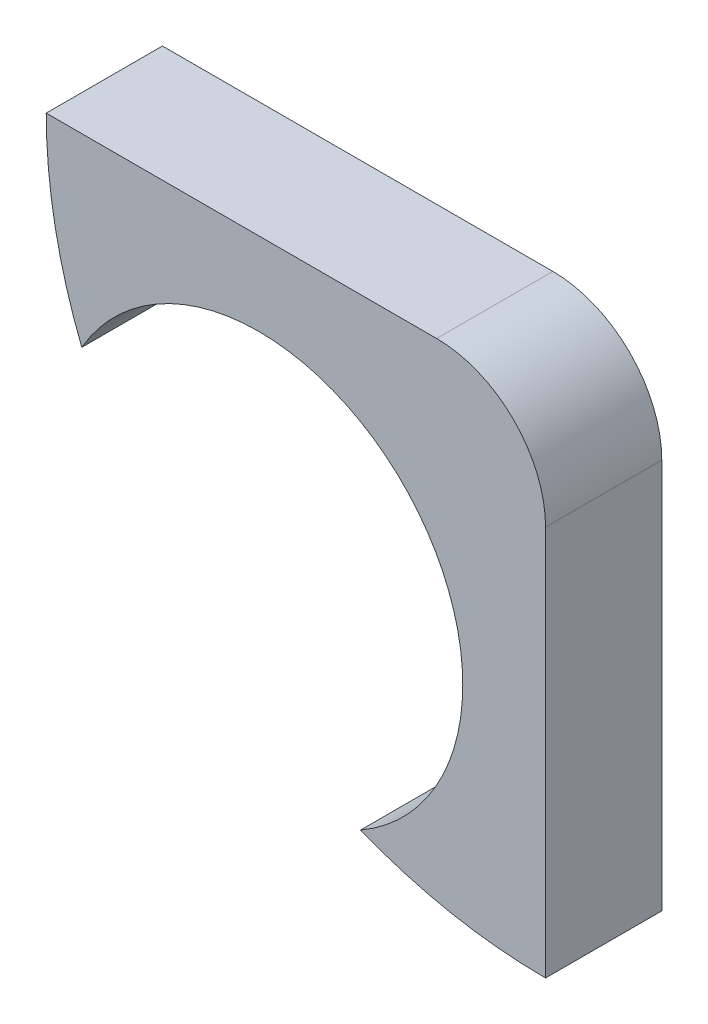
ISO-10303-21;
HEADER;
FILE_DESCRIPTION(('STEP AP214'),'2;1');
FILE_NAME('part.step','',(''),(''),'','','');
FILE_SCHEMA(('AUTOMOTIVE_DESIGN { 1 0 10303 214 1 1 1 1 }'));
ENDSEC;
DATA;
#1=APPLICATION_CONTEXT('core data for automotive mechanical design processes');
#2=APPLICATION_PROTOCOL_DEFINITION('international standard','automotive_design',2000,#1);
#3=PRODUCT_CONTEXT('',#1,'mechanical');
#4=PRODUCT('Part','Part','',(#3));
#5=PRODUCT_RELATED_PRODUCT_CATEGORY('part','',(#4));
#6=PRODUCT_DEFINITION_FORMATION('','',#4);
#7=PRODUCT_DEFINITION_CONTEXT('part definition',#1,'design');
#8=PRODUCT_DEFINITION('design','',#6,#7);
#9=PRODUCT_DEFINITION_SHAPE('','',#8);
#10=(LENGTH_UNIT() NAMED_UNIT(*) SI_UNIT(.MILLI.,.METRE.));
#11=(NAMED_UNIT(*) PLANE_ANGLE_UNIT() SI_UNIT($,.RADIAN.));
#12=(NAMED_UNIT(*) SI_UNIT($,.STERADIAN.) SOLID_ANGLE_UNIT());
#13=UNCERTAINTY_MEASURE_WITH_UNIT(LENGTH_MEASURE(1.E-05),#10,'distance_accuracy_value','');
#14=(GEOMETRIC_REPRESENTATION_CONTEXT(3) GLOBAL_UNCERTAINTY_ASSIGNED_CONTEXT((#13)) GLOBAL_UNIT_ASSIGNED_CONTEXT((#10,
#11,#12)) REPRESENTATION_CONTEXT('',''));
#15=CARTESIAN_POINT('',(0.,0.,0.));
#16=DIRECTION('',(0.,0.,1.));
#17=DIRECTION('',(1.,0.,0.));
#18=AXIS2_PLACEMENT_3D('',#15,#16,#17);
#19=CARTESIAN_POINT('',(19.95,19.95,18.95));
#20=DIRECTION('',(0.,0.,1.));
#21=DIRECTION('',(1.,0.,0.));
#22=AXIS2_PLACEMENT_3D('',#19,#20,#21);
#23=PLANE('',#22);
#24=CARTESIAN_POINT('',(19.95,19.95,18.95));
#25=DIRECTION('',(0.,0.,1.));
#26=DIRECTION('',(1.,0.,0.));
#27=AXIS2_PLACEMENT_3D('',#24,#25,#26);
#28=CIRCLE('',#27,6.875);
#29=CARTESIAN_POINT('',(17.4018583423999,13.5646574803852,18.95));
#30=VERTEX_POINT('',#29);
#31=CARTESIAN_POINT('',(19.95,13.0750000000002,18.95));
#32=VERTEX_POINT('',#31);
#33=EDGE_CURVE('E86',#30,#32,#28,.T.);
#34=ORIENTED_EDGE('',*,*,#33,.F.);
#35=CARTESIAN_POINT('',(16.,16.,18.95));
#36=DIRECTION('',(0.,0.,-1.));
#37=DIRECTION('',(1.,0.,0.));
#38=AXIS2_PLACEMENT_3D('',#35,#36,#37);
#39=CIRCLE('',#38,2.81);
#40=CARTESIAN_POINT('',(13.564657480385,17.4018583423996,18.95));
#41=VERTEX_POINT('',#40);
#42=EDGE_CURVE('E26',#41,#30,#39,.T.);
#43=ORIENTED_EDGE('',*,*,#42,.F.);
#44=CARTESIAN_POINT('',(19.95,19.95,18.95));
#45=DIRECTION('',(0.,0.,1.));
#46=DIRECTION('',(1.,0.,0.));
#47=AXIS2_PLACEMENT_3D('',#44,#45,#46);
#48=CIRCLE('',#47,6.875);
#49=CARTESIAN_POINT('',(13.0749999999998,19.95,18.95));
#50=VERTEX_POINT('',#49);
#51=EDGE_CURVE('E19',#50,#41,#48,.T.);
#52=ORIENTED_EDGE('',*,*,#51,.F.);
#53=DIRECTION('',(-1.,0.,0.));
#54=VECTOR('',#53,1.);
#55=CARTESIAN_POINT('',(18.45,19.95,18.95));
#56=LINE('',#55,#54);
#57=CARTESIAN_POINT('',(18.45,19.95,18.95));
#58=VERTEX_POINT('',#57);
#59=EDGE_CURVE('E134',#58,#50,#56,.T.);
#60=ORIENTED_EDGE('',*,*,#59,.F.);
#61=CARTESIAN_POINT('',(18.45,18.45,18.95));
#62=DIRECTION('',(0.,0.,1.));
#63=DIRECTION('',(1.,0.,0.));
#64=AXIS2_PLACEMENT_3D('',#61,#62,#63);
#65=CIRCLE('',#64,1.5);
#66=CARTESIAN_POINT('',(19.95,18.45,18.95));
#67=VERTEX_POINT('',#66);
#68=EDGE_CURVE('E88',#67,#58,#65,.T.);
#69=ORIENTED_EDGE('',*,*,#68,.F.);
#70=DIRECTION('',(0.,1.,0.));
#71=VECTOR('',#70,1.);
#72=CARTESIAN_POINT('',(19.95,13.0750000000002,18.95));
#73=LINE('',#72,#71);
#74=EDGE_CURVE('E83',#32,#67,#73,.T.);
#75=ORIENTED_EDGE('',*,*,#74,.F.);
#76=EDGE_LOOP('',(#34,#43,#52,#60,#69,#75));
#77=FACE_BOUND('',#76,.T.);
#78=ADVANCED_FACE('F15',(#77),#23,.F.);
#79=CARTESIAN_POINT('',(19.95,19.95,20.55));
#80=DIRECTION('',(0.,0.,1.));
#81=DIRECTION('',(1.,0.,0.));
#82=AXIS2_PLACEMENT_3D('',#79,#80,#81);
#83=PLANE('',#82);
#84=CARTESIAN_POINT('',(19.95,19.95,20.55));
#85=DIRECTION('',(0.,0.,1.));
#86=DIRECTION('',(1.,0.,0.));
#87=AXIS2_PLACEMENT_3D('',#84,#85,#86);
#88=CIRCLE('',#87,6.875);
#89=CARTESIAN_POINT('',(17.4018583423999,13.5646574803852,20.55));
#90=VERTEX_POINT('',#89);
#91=CARTESIAN_POINT('',(19.95,13.0750000000002,20.55));
#92=VERTEX_POINT('',#91);
#93=EDGE_CURVE('E105',#90,#92,#88,.T.);
#94=ORIENTED_EDGE('',*,*,#93,.T.);
#95=DIRECTION('',(0.,1.,0.));
#96=VECTOR('',#95,1.);
#97=CARTESIAN_POINT('',(19.95,13.0750000000002,20.55));
#98=LINE('',#97,#96);
#99=CARTESIAN_POINT('',(19.95,18.45,20.55));
#100=VERTEX_POINT('',#99);
#101=EDGE_CURVE('E100',#92,#100,#98,.T.);
#102=ORIENTED_EDGE('',*,*,#101,.T.);
#103=CARTESIAN_POINT('',(18.45,18.45,20.55));
#104=DIRECTION('',(0.,0.,1.));
#105=DIRECTION('',(1.,0.,0.));
#106=AXIS2_PLACEMENT_3D('',#103,#104,#105);
#107=CIRCLE('',#106,1.5);
#108=CARTESIAN_POINT('',(18.45,19.95,20.55));
#109=VERTEX_POINT('',#108);
#110=EDGE_CURVE('E122',#100,#109,#107,.T.);
#111=ORIENTED_EDGE('',*,*,#110,.T.);
#112=DIRECTION('',(-1.,0.,0.));
#113=VECTOR('',#112,1.);
#114=CARTESIAN_POINT('',(18.45,19.95,20.55));
#115=LINE('',#114,#113);
#116=CARTESIAN_POINT('',(13.0749999999998,19.95,20.55));
#117=VERTEX_POINT('',#116);
#118=EDGE_CURVE('E143',#109,#117,#115,.T.);
#119=ORIENTED_EDGE('',*,*,#118,.T.);
#120=CARTESIAN_POINT('',(19.95,19.95,20.55));
#121=DIRECTION('',(0.,0.,1.));
#122=DIRECTION('',(1.,0.,0.));
#123=AXIS2_PLACEMENT_3D('',#120,#121,#122);
#124=CIRCLE('',#123,6.875);
#125=CARTESIAN_POINT('',(13.564657480385,17.4018583423996,20.55));
#126=VERTEX_POINT('',#125);
#127=EDGE_CURVE('E149',#117,#126,#124,.T.);
#128=ORIENTED_EDGE('',*,*,#127,.T.);
#129=CARTESIAN_POINT('',(16.,16.,20.55));
#130=DIRECTION('',(0.,0.,-1.));
#131=DIRECTION('',(1.,0.,0.));
#132=AXIS2_PLACEMENT_3D('',#129,#130,#131);
#133=CIRCLE('',#132,2.81);
#134=EDGE_CURVE('E10',#126,#90,#133,.T.);
#135=ORIENTED_EDGE('',*,*,#134,.T.);
#136=EDGE_LOOP('',(#94,#102,#111,#119,#128,#135));
#137=FACE_BOUND('',#136,.T.);
#138=ADVANCED_FACE('F276',(#137),#83,.T.);
#139=CARTESIAN_POINT('',(16.,16.,20.55));
#140=DIRECTION('',(0.,0.,-1.));
#141=DIRECTION('',(-1.,0.,0.));
#142=AXIS2_PLACEMENT_3D('',#139,#140,#141);
#143=CYLINDRICAL_SURFACE('',#142,2.81);
#144=ORIENTED_EDGE('',*,*,#42,.T.);
#145=DIRECTION('',(0.,0.,-1.));
#146=VECTOR('',#145,1.);
#147=CARTESIAN_POINT('',(17.4018583423999,13.5646574803852,20.55));
#148=LINE('',#147,#146);
#149=EDGE_CURVE('E94',#90,#30,#148,.T.);
#150=ORIENTED_EDGE('',*,*,#149,.F.);
#151=ORIENTED_EDGE('',*,*,#134,.F.);
#152=DIRECTION('',(0.,0.,-1.));
#153=VECTOR('',#152,1.);
#154=CARTESIAN_POINT('',(13.564657480385,17.4018583423996,20.55));
#155=LINE('',#154,#153);
#156=EDGE_CURVE('E152',#126,#41,#155,.T.);
#157=ORIENTED_EDGE('',*,*,#156,.T.);
#158=EDGE_LOOP('',(#144,#150,#151,#157));
#159=FACE_BOUND('',#158,.T.);
#160=ADVANCED_FACE('F280',(#159),#143,.F.);
#161=CARTESIAN_POINT('',(19.95,19.95,20.55));
#162=DIRECTION('',(0.,0.,-1.));
#163=DIRECTION('',(-1.,0.,0.));
#164=AXIS2_PLACEMENT_3D('',#161,#162,#163);
#165=CYLINDRICAL_SURFACE('',#164,6.875);
#166=ORIENTED_EDGE('',*,*,#51,.T.);
#167=ORIENTED_EDGE('',*,*,#156,.F.);
#168=ORIENTED_EDGE('',*,*,#127,.F.);
#169=DIRECTION('',(0.,0.,-1.));
#170=VECTOR('',#169,1.);
#171=CARTESIAN_POINT('',(13.0749999999998,19.95,20.55));
#172=LINE('',#171,#170);
#173=EDGE_CURVE('E137',#117,#50,#172,.T.);
#174=ORIENTED_EDGE('',*,*,#173,.T.);
#175=EDGE_LOOP('',(#166,#167,#168,#174));
#176=FACE_BOUND('',#175,.T.);
#177=ADVANCED_FACE('F167',(#176),#165,.T.);
#178=CARTESIAN_POINT('',(18.45,19.95,20.55));
#179=DIRECTION('',(0.,-1.,0.));
#180=DIRECTION('',(0.,0.,-1.));
#181=AXIS2_PLACEMENT_3D('',#178,#179,#180);
#182=PLANE('',#181);
#183=ORIENTED_EDGE('',*,*,#59,.T.);
#184=ORIENTED_EDGE('',*,*,#173,.F.);
#185=ORIENTED_EDGE('',*,*,#118,.F.);
#186=DIRECTION('',(0.,0.,-1.));
#187=VECTOR('',#186,1.);
#188=CARTESIAN_POINT('',(18.45,19.95,20.55));
#189=LINE('',#188,#187);
#190=EDGE_CURVE('E114',#109,#58,#189,.T.);
#191=ORIENTED_EDGE('',*,*,#190,.T.);
#192=EDGE_LOOP('',(#183,#184,#185,#191));
#193=FACE_BOUND('',#192,.T.);
#194=ADVANCED_FACE('F258',(#193),#182,.F.);
#195=CARTESIAN_POINT('',(18.45,18.45,20.55));
#196=DIRECTION('',(0.,0.,-1.));
#197=DIRECTION('',(-1.,0.,0.));
#198=AXIS2_PLACEMENT_3D('',#195,#196,#197);
#199=CYLINDRICAL_SURFACE('',#198,1.5);
#200=ORIENTED_EDGE('',*,*,#68,.T.);
#201=ORIENTED_EDGE('',*,*,#190,.F.);
#202=ORIENTED_EDGE('',*,*,#110,.F.);
#203=DIRECTION('',(0.,0.,-1.));
#204=VECTOR('',#203,1.);
#205=CARTESIAN_POINT('',(19.95,18.45,20.55));
#206=LINE('',#205,#204);
#207=EDGE_CURVE('E93',#100,#67,#206,.T.);
#208=ORIENTED_EDGE('',*,*,#207,.T.);
#209=EDGE_LOOP('',(#200,#201,#202,#208));
#210=FACE_BOUND('',#209,.T.);
#211=ADVANCED_FACE('F254',(#210),#199,.T.);
#212=CARTESIAN_POINT('',(19.95,13.0750000000002,20.55));
#213=DIRECTION('',(-1.,0.,0.));
#214=DIRECTION('',(0.,0.,1.));
#215=AXIS2_PLACEMENT_3D('',#212,#213,#214);
#216=PLANE('',#215);
#217=ORIENTED_EDGE('',*,*,#74,.T.);
#218=ORIENTED_EDGE('',*,*,#207,.F.);
#219=ORIENTED_EDGE('',*,*,#101,.F.);
#220=DIRECTION('',(0.,0.,-1.));
#221=VECTOR('',#220,1.);
#222=CARTESIAN_POINT('',(19.95,13.0750000000002,20.55));
#223=LINE('',#222,#221);
#224=EDGE_CURVE('E97',#92,#32,#223,.T.);
#225=ORIENTED_EDGE('',*,*,#224,.T.);
#226=EDGE_LOOP('',(#217,#218,#219,#225));
#227=FACE_BOUND('',#226,.T.);
#228=ADVANCED_FACE('F98',(#227),#216,.F.);
#229=CARTESIAN_POINT('',(19.95,19.95,20.55));
#230=DIRECTION('',(0.,0.,-1.));
#231=DIRECTION('',(-1.,0.,0.));
#232=AXIS2_PLACEMENT_3D('',#229,#230,#231);
#233=CYLINDRICAL_SURFACE('',#232,6.875);
#234=ORIENTED_EDGE('',*,*,#33,.T.);
#235=ORIENTED_EDGE('',*,*,#224,.F.);
#236=ORIENTED_EDGE('',*,*,#93,.F.);
#237=ORIENTED_EDGE('',*,*,#149,.T.);
#238=EDGE_LOOP('',(#234,#235,#236,#237));
#239=FACE_BOUND('',#238,.T.);
#240=ADVANCED_FACE('F17',(#239),#233,.T.);
#241=CLOSED_SHELL('',(#78,#138,#160,#177,#194,#211,#228,#240));
#242=MANIFOLD_SOLID_BREP('B1',#241);
#243=ADVANCED_BREP_SHAPE_REPRESENTATION('',(#18,#242),#14);
#244=SHAPE_DEFINITION_REPRESENTATION(#9,#243);
ENDSEC;
END-ISO-10303-21;
